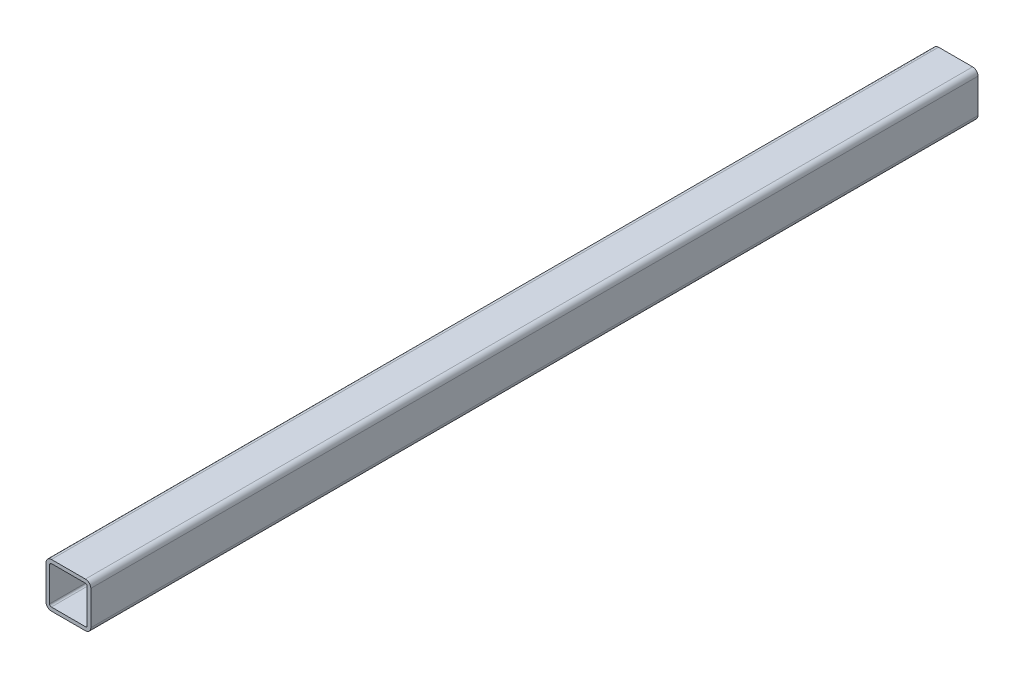
ISO-10303-21;
HEADER;
FILE_DESCRIPTION(('STEP AP214'),'2;1');
FILE_NAME('part.step','',(''),(''),'','','');
FILE_SCHEMA(('AUTOMOTIVE_DESIGN { 1 0 10303 214 1 1 1 1 }'));
ENDSEC;
DATA;
#1=APPLICATION_CONTEXT('core data for automotive mechanical design processes');
#2=APPLICATION_PROTOCOL_DEFINITION('international standard','automotive_design',2000,#1);
#3=PRODUCT_CONTEXT('',#1,'mechanical');
#4=PRODUCT('Part','Part','',(#3));
#5=PRODUCT_RELATED_PRODUCT_CATEGORY('part','',(#4));
#6=PRODUCT_DEFINITION_FORMATION('','',#4);
#7=PRODUCT_DEFINITION_CONTEXT('part definition',#1,'design');
#8=PRODUCT_DEFINITION('design','',#6,#7);
#9=PRODUCT_DEFINITION_SHAPE('','',#8);
#10=(LENGTH_UNIT() NAMED_UNIT(*) SI_UNIT(.MILLI.,.METRE.));
#11=(NAMED_UNIT(*) PLANE_ANGLE_UNIT() SI_UNIT($,.RADIAN.));
#12=(NAMED_UNIT(*) SI_UNIT($,.STERADIAN.) SOLID_ANGLE_UNIT());
#13=UNCERTAINTY_MEASURE_WITH_UNIT(LENGTH_MEASURE(1.E-05),#10,'distance_accuracy_value','');
#14=(GEOMETRIC_REPRESENTATION_CONTEXT(3) GLOBAL_UNCERTAINTY_ASSIGNED_CONTEXT((#13)) GLOBAL_UNIT_ASSIGNED_CONTEXT((#10,
#11,#12)) REPRESENTATION_CONTEXT('',''));
#15=CARTESIAN_POINT('',(0.,0.,0.));
#16=DIRECTION('',(0.,0.,1.));
#17=DIRECTION('',(1.,0.,0.));
#18=AXIS2_PLACEMENT_3D('',#15,#16,#17);
#19=CARTESIAN_POINT('',(0.,0.,495.));
#20=DIRECTION('',(0.,0.,1.));
#21=DIRECTION('',(1.,0.,0.));
#22=AXIS2_PLACEMENT_3D('',#19,#20,#21);
#23=PLANE('',#22);
#24=DIRECTION('',(0.,1.,0.));
#25=VECTOR('',#24,1.);
#26=CARTESIAN_POINT('',(-12.5,-4.75,495.));
#27=LINE('',#26,#25);
#28=CARTESIAN_POINT('',(-12.5,-9.5,495.));
#29=VERTEX_POINT('',#28);
#30=CARTESIAN_POINT('',(-12.5,9.5,495.));
#31=VERTEX_POINT('',#30);
#32=EDGE_CURVE('E204',#29,#31,#27,.T.);
#33=ORIENTED_EDGE('',*,*,#32,.F.);
#34=CARTESIAN_POINT('',(-9.5,-9.5,495.));
#35=DIRECTION('',(0.,0.,-1.));
#36=DIRECTION('',(1.,0.,0.));
#37=AXIS2_PLACEMENT_3D('',#34,#35,#36);
#38=CIRCLE('',#37,3.);
#39=CARTESIAN_POINT('',(-9.5,-12.5,495.));
#40=VERTEX_POINT('',#39);
#41=EDGE_CURVE('E275',#40,#29,#38,.T.);
#42=ORIENTED_EDGE('',*,*,#41,.F.);
#43=DIRECTION('',(-1.,0.,0.));
#44=VECTOR('',#43,1.);
#45=CARTESIAN_POINT('',(4.75,-12.5,495.));
#46=LINE('',#45,#44);
#47=CARTESIAN_POINT('',(9.5,-12.5,495.));
#48=VERTEX_POINT('',#47);
#49=EDGE_CURVE('E252',#48,#40,#46,.T.);
#50=ORIENTED_EDGE('',*,*,#49,.F.);
#51=CARTESIAN_POINT('',(9.5,-9.5,495.));
#52=DIRECTION('',(0.,0.,-1.));
#53=DIRECTION('',(0.,1.,0.));
#54=AXIS2_PLACEMENT_3D('',#51,#52,#53);
#55=CIRCLE('',#54,3.);
#56=CARTESIAN_POINT('',(12.5,-9.5,495.));
#57=VERTEX_POINT('',#56);
#58=EDGE_CURVE('E217',#57,#48,#55,.T.);
#59=ORIENTED_EDGE('',*,*,#58,.F.);
#60=DIRECTION('',(0.,-1.,0.));
#61=VECTOR('',#60,1.);
#62=CARTESIAN_POINT('',(12.5,4.75,495.));
#63=LINE('',#62,#61);
#64=CARTESIAN_POINT('',(12.5,9.5,495.));
#65=VERTEX_POINT('',#64);
#66=EDGE_CURVE('E237',#65,#57,#63,.T.);
#67=ORIENTED_EDGE('',*,*,#66,.F.);
#68=CARTESIAN_POINT('',(9.5,9.5,495.));
#69=DIRECTION('',(0.,0.,-1.));
#70=DIRECTION('',(-1.,0.,0.));
#71=AXIS2_PLACEMENT_3D('',#68,#69,#70);
#72=CIRCLE('',#71,3.);
#73=CARTESIAN_POINT('',(9.5,12.5,495.));
#74=VERTEX_POINT('',#73);
#75=EDGE_CURVE('E27',#74,#65,#72,.T.);
#76=ORIENTED_EDGE('',*,*,#75,.F.);
#77=DIRECTION('',(1.,0.,0.));
#78=VECTOR('',#77,1.);
#79=CARTESIAN_POINT('',(-4.75,12.5,495.));
#80=LINE('',#79,#78);
#81=CARTESIAN_POINT('',(-9.5,12.5,495.));
#82=VERTEX_POINT('',#81);
#83=EDGE_CURVE('E222',#82,#74,#80,.T.);
#84=ORIENTED_EDGE('',*,*,#83,.F.);
#85=CARTESIAN_POINT('',(-9.5,9.5,495.));
#86=DIRECTION('',(0.,0.,-1.));
#87=DIRECTION('',(0.,-1.,0.));
#88=AXIS2_PLACEMENT_3D('',#85,#86,#87);
#89=CIRCLE('',#88,3.);
#90=EDGE_CURVE('E210',#31,#82,#89,.T.);
#91=ORIENTED_EDGE('',*,*,#90,.F.);
#92=EDGE_LOOP('',(#33,#42,#50,#59,#67,#76,#84,#91));
#93=FACE_BOUND('',#92,.T.);
#94=DIRECTION('',(-1.,0.,0.));
#95=VECTOR('',#94,1.);
#96=CARTESIAN_POINT('',(-4.75,10.5,495.));
#97=LINE('',#96,#95);
#98=CARTESIAN_POINT('',(9.5,10.5,495.));
#99=VERTEX_POINT('',#98);
#100=CARTESIAN_POINT('',(-9.5,10.5,495.));
#101=VERTEX_POINT('',#100);
#102=EDGE_CURVE('E257',#99,#101,#97,.T.);
#103=ORIENTED_EDGE('',*,*,#102,.F.);
#104=CARTESIAN_POINT('',(9.5,9.5,495.));
#105=DIRECTION('',(0.,0.,1.));
#106=DIRECTION('',(-1.,0.,0.));
#107=AXIS2_PLACEMENT_3D('',#104,#105,#106);
#108=CIRCLE('',#107,1.);
#109=CARTESIAN_POINT('',(10.5,9.5,495.));
#110=VERTEX_POINT('',#109);
#111=EDGE_CURVE('E320',#110,#99,#108,.T.);
#112=ORIENTED_EDGE('',*,*,#111,.F.);
#113=DIRECTION('',(0.,1.,0.));
#114=VECTOR('',#113,1.);
#115=CARTESIAN_POINT('',(10.5,4.75,495.));
#116=LINE('',#115,#114);
#117=CARTESIAN_POINT('',(10.5,-9.5,495.));
#118=VERTEX_POINT('',#117);
#119=EDGE_CURVE('E236',#118,#110,#116,.T.);
#120=ORIENTED_EDGE('',*,*,#119,.F.);
#121=CARTESIAN_POINT('',(9.5,-9.5,495.));
#122=DIRECTION('',(0.,0.,1.));
#123=DIRECTION('',(0.,1.,0.));
#124=AXIS2_PLACEMENT_3D('',#121,#122,#123);
#125=CIRCLE('',#124,1.);
#126=CARTESIAN_POINT('',(9.5,-10.5,495.));
#127=VERTEX_POINT('',#126);
#128=EDGE_CURVE('E251',#127,#118,#125,.T.);
#129=ORIENTED_EDGE('',*,*,#128,.F.);
#130=DIRECTION('',(1.,0.,0.));
#131=VECTOR('',#130,1.);
#132=CARTESIAN_POINT('',(4.75,-10.5,495.));
#133=LINE('',#132,#131);
#134=CARTESIAN_POINT('',(-9.5,-10.5,495.));
#135=VERTEX_POINT('',#134);
#136=EDGE_CURVE('E349',#135,#127,#133,.T.);
#137=ORIENTED_EDGE('',*,*,#136,.F.);
#138=CARTESIAN_POINT('',(-9.5,-9.5,495.));
#139=DIRECTION('',(0.,0.,1.));
#140=DIRECTION('',(1.,0.,0.));
#141=AXIS2_PLACEMENT_3D('',#138,#139,#140);
#142=CIRCLE('',#141,1.);
#143=CARTESIAN_POINT('',(-10.5,-9.5,495.));
#144=VERTEX_POINT('',#143);
#145=EDGE_CURVE('E190',#144,#135,#142,.T.);
#146=ORIENTED_EDGE('',*,*,#145,.F.);
#147=DIRECTION('',(0.,-1.,0.));
#148=VECTOR('',#147,1.);
#149=CARTESIAN_POINT('',(-10.5,-4.75,495.));
#150=LINE('',#149,#148);
#151=CARTESIAN_POINT('',(-10.5,9.5,495.));
#152=VERTEX_POINT('',#151);
#153=EDGE_CURVE('E175',#152,#144,#150,.T.);
#154=ORIENTED_EDGE('',*,*,#153,.F.);
#155=CARTESIAN_POINT('',(-9.5,9.5,495.));
#156=DIRECTION('',(0.,0.,1.));
#157=DIRECTION('',(0.,-1.,0.));
#158=AXIS2_PLACEMENT_3D('',#155,#156,#157);
#159=CIRCLE('',#158,1.);
#160=EDGE_CURVE('E205',#101,#152,#159,.T.);
#161=ORIENTED_EDGE('',*,*,#160,.F.);
#162=EDGE_LOOP('',(#103,#112,#120,#129,#137,#146,#154,#161));
#163=FACE_BOUND('',#162,.T.);
#164=ADVANCED_FACE('F16',(#93,#163),#23,.T.);
#165=CARTESIAN_POINT('',(0.,0.,0.));
#166=DIRECTION('',(0.,0.,1.));
#167=DIRECTION('',(1.,0.,0.));
#168=AXIS2_PLACEMENT_3D('',#165,#166,#167);
#169=PLANE('',#168);
#170=DIRECTION('',(0.,1.,0.));
#171=VECTOR('',#170,1.);
#172=CARTESIAN_POINT('',(-12.5,-4.75,0.));
#173=LINE('',#172,#171);
#174=CARTESIAN_POINT('',(-12.5,-9.5,0.));
#175=VERTEX_POINT('',#174);
#176=CARTESIAN_POINT('',(-12.5,9.5,0.));
#177=VERTEX_POINT('',#176);
#178=EDGE_CURVE('E206',#175,#177,#173,.T.);
#179=ORIENTED_EDGE('',*,*,#178,.T.);
#180=CARTESIAN_POINT('',(-9.5,9.5,0.));
#181=DIRECTION('',(0.,0.,-1.));
#182=DIRECTION('',(0.,-1.,0.));
#183=AXIS2_PLACEMENT_3D('',#180,#181,#182);
#184=CIRCLE('',#183,3.);
#185=CARTESIAN_POINT('',(-9.5,12.5,0.));
#186=VERTEX_POINT('',#185);
#187=EDGE_CURVE('E218',#177,#186,#184,.T.);
#188=ORIENTED_EDGE('',*,*,#187,.T.);
#189=DIRECTION('',(1.,0.,0.));
#190=VECTOR('',#189,1.);
#191=CARTESIAN_POINT('',(-4.75,12.5,0.));
#192=LINE('',#191,#190);
#193=CARTESIAN_POINT('',(9.5,12.5,0.));
#194=VERTEX_POINT('',#193);
#195=EDGE_CURVE('E245',#186,#194,#192,.T.);
#196=ORIENTED_EDGE('',*,*,#195,.T.);
#197=CARTESIAN_POINT('',(9.5,9.5,0.));
#198=DIRECTION('',(0.,0.,-1.));
#199=DIRECTION('',(-1.,0.,0.));
#200=AXIS2_PLACEMENT_3D('',#197,#198,#199);
#201=CIRCLE('',#200,3.);
#202=CARTESIAN_POINT('',(12.5,9.5,0.));
#203=VERTEX_POINT('',#202);
#204=EDGE_CURVE('E11',#194,#203,#201,.T.);
#205=ORIENTED_EDGE('',*,*,#204,.T.);
#206=DIRECTION('',(0.,-1.,0.));
#207=VECTOR('',#206,1.);
#208=CARTESIAN_POINT('',(12.5,4.75,0.));
#209=LINE('',#208,#207);
#210=CARTESIAN_POINT('',(12.5,-9.5,0.));
#211=VERTEX_POINT('',#210);
#212=EDGE_CURVE('E286',#203,#211,#209,.T.);
#213=ORIENTED_EDGE('',*,*,#212,.T.);
#214=CARTESIAN_POINT('',(9.5,-9.5,0.));
#215=DIRECTION('',(0.,0.,-1.));
#216=DIRECTION('',(0.,1.,0.));
#217=AXIS2_PLACEMENT_3D('',#214,#215,#216);
#218=CIRCLE('',#217,3.);
#219=CARTESIAN_POINT('',(9.5,-12.5,0.));
#220=VERTEX_POINT('',#219);
#221=EDGE_CURVE('E216',#211,#220,#218,.T.);
#222=ORIENTED_EDGE('',*,*,#221,.T.);
#223=DIRECTION('',(-1.,0.,0.));
#224=VECTOR('',#223,1.);
#225=CARTESIAN_POINT('',(4.75,-12.5,0.));
#226=LINE('',#225,#224);
#227=CARTESIAN_POINT('',(-9.5,-12.5,0.));
#228=VERTEX_POINT('',#227);
#229=EDGE_CURVE('E271',#220,#228,#226,.T.);
#230=ORIENTED_EDGE('',*,*,#229,.T.);
#231=CARTESIAN_POINT('',(-9.5,-9.5,0.));
#232=DIRECTION('',(0.,0.,-1.));
#233=DIRECTION('',(1.,0.,0.));
#234=AXIS2_PLACEMENT_3D('',#231,#232,#233);
#235=CIRCLE('',#234,3.);
#236=EDGE_CURVE('E262',#228,#175,#235,.T.);
#237=ORIENTED_EDGE('',*,*,#236,.T.);
#238=EDGE_LOOP('',(#179,#188,#196,#205,#213,#222,#230,#237));
#239=FACE_BOUND('',#238,.T.);
#240=DIRECTION('',(-1.,0.,0.));
#241=VECTOR('',#240,1.);
#242=CARTESIAN_POINT('',(-4.75,10.5,0.));
#243=LINE('',#242,#241);
#244=CARTESIAN_POINT('',(9.5,10.5,0.));
#245=VERTEX_POINT('',#244);
#246=CARTESIAN_POINT('',(-9.5,10.5,0.));
#247=VERTEX_POINT('',#246);
#248=EDGE_CURVE('E196',#245,#247,#243,.T.);
#249=ORIENTED_EDGE('',*,*,#248,.T.);
#250=CARTESIAN_POINT('',(-9.5,9.5,0.));
#251=DIRECTION('',(0.,0.,1.));
#252=DIRECTION('',(0.,-1.,0.));
#253=AXIS2_PLACEMENT_3D('',#250,#251,#252);
#254=CIRCLE('',#253,1.);
#255=CARTESIAN_POINT('',(-10.5,9.5,0.));
#256=VERTEX_POINT('',#255);
#257=EDGE_CURVE('E169',#247,#256,#254,.T.);
#258=ORIENTED_EDGE('',*,*,#257,.T.);
#259=DIRECTION('',(0.,-1.,0.));
#260=VECTOR('',#259,1.);
#261=CARTESIAN_POINT('',(-10.5,-4.75,0.));
#262=LINE('',#261,#260);
#263=CARTESIAN_POINT('',(-10.5,-9.5,0.));
#264=VERTEX_POINT('',#263);
#265=EDGE_CURVE('E161',#256,#264,#262,.T.);
#266=ORIENTED_EDGE('',*,*,#265,.T.);
#267=CARTESIAN_POINT('',(-9.5,-9.5,0.));
#268=DIRECTION('',(0.,0.,1.));
#269=DIRECTION('',(1.,0.,0.));
#270=AXIS2_PLACEMENT_3D('',#267,#268,#269);
#271=CIRCLE('',#270,1.);
#272=CARTESIAN_POINT('',(-9.5,-10.5,0.));
#273=VERTEX_POINT('',#272);
#274=EDGE_CURVE('E167',#264,#273,#271,.T.);
#275=ORIENTED_EDGE('',*,*,#274,.T.);
#276=DIRECTION('',(1.,0.,0.));
#277=VECTOR('',#276,1.);
#278=CARTESIAN_POINT('',(4.75,-10.5,0.));
#279=LINE('',#278,#277);
#280=CARTESIAN_POINT('',(9.5,-10.5,0.));
#281=VERTEX_POINT('',#280);
#282=EDGE_CURVE('E200',#273,#281,#279,.T.);
#283=ORIENTED_EDGE('',*,*,#282,.T.);
#284=CARTESIAN_POINT('',(9.5,-9.5,0.));
#285=DIRECTION('',(0.,0.,1.));
#286=DIRECTION('',(0.,1.,0.));
#287=AXIS2_PLACEMENT_3D('',#284,#285,#286);
#288=CIRCLE('',#287,1.);
#289=CARTESIAN_POINT('',(10.5,-9.5,0.));
#290=VERTEX_POINT('',#289);
#291=EDGE_CURVE('E250',#281,#290,#288,.T.);
#292=ORIENTED_EDGE('',*,*,#291,.T.);
#293=DIRECTION('',(0.,1.,0.));
#294=VECTOR('',#293,1.);
#295=CARTESIAN_POINT('',(10.5,4.75,0.));
#296=LINE('',#295,#294);
#297=CARTESIAN_POINT('',(10.5,9.5,0.));
#298=VERTEX_POINT('',#297);
#299=EDGE_CURVE('E235',#290,#298,#296,.T.);
#300=ORIENTED_EDGE('',*,*,#299,.T.);
#301=CARTESIAN_POINT('',(9.5,9.5,0.));
#302=DIRECTION('',(0.,0.,1.));
#303=DIRECTION('',(-1.,0.,0.));
#304=AXIS2_PLACEMENT_3D('',#301,#302,#303);
#305=CIRCLE('',#304,1.);
#306=EDGE_CURVE('E241',#298,#245,#305,.T.);
#307=ORIENTED_EDGE('',*,*,#306,.T.);
#308=EDGE_LOOP('',(#249,#258,#266,#275,#283,#292,#300,#307));
#309=FACE_BOUND('',#308,.T.);
#310=ADVANCED_FACE('F164',(#239,#309),#169,.F.);
#311=CARTESIAN_POINT('',(9.5,9.5,0.));
#312=DIRECTION('',(0.,0.,1.));
#313=DIRECTION('',(-1.,0.,0.));
#314=AXIS2_PLACEMENT_3D('',#311,#312,#313);
#315=CYLINDRICAL_SURFACE('',#314,3.);
#316=ORIENTED_EDGE('',*,*,#75,.T.);
#317=DIRECTION('',(0.,0.,1.));
#318=VECTOR('',#317,1.);
#319=CARTESIAN_POINT('',(12.5,9.5,0.));
#320=LINE('',#319,#318);
#321=EDGE_CURVE('E266',#203,#65,#320,.T.);
#322=ORIENTED_EDGE('',*,*,#321,.F.);
#323=ORIENTED_EDGE('',*,*,#204,.F.);
#324=DIRECTION('',(0.,0.,1.));
#325=VECTOR('',#324,1.);
#326=CARTESIAN_POINT('',(9.5,12.5,0.));
#327=LINE('',#326,#325);
#328=EDGE_CURVE('E230',#194,#74,#327,.T.);
#329=ORIENTED_EDGE('',*,*,#328,.T.);
#330=EDGE_LOOP('',(#316,#322,#323,#329));
#331=FACE_BOUND('',#330,.T.);
#332=ADVANCED_FACE('F409',(#331),#315,.T.);
#333=CARTESIAN_POINT('',(-9.5,12.5,0.));
#334=DIRECTION('',(0.,1.,0.));
#335=DIRECTION('',(1.,0.,0.));
#336=AXIS2_PLACEMENT_3D('',#333,#334,#335);
#337=PLANE('',#336);
#338=ORIENTED_EDGE('',*,*,#83,.T.);
#339=ORIENTED_EDGE('',*,*,#328,.F.);
#340=ORIENTED_EDGE('',*,*,#195,.F.);
#341=DIRECTION('',(0.,0.,1.));
#342=VECTOR('',#341,1.);
#343=CARTESIAN_POINT('',(-9.5,12.5,0.));
#344=LINE('',#343,#342);
#345=EDGE_CURVE('E223',#186,#82,#344,.T.);
#346=ORIENTED_EDGE('',*,*,#345,.T.);
#347=EDGE_LOOP('',(#338,#339,#340,#346));
#348=FACE_BOUND('',#347,.T.);
#349=ADVANCED_FACE('F449',(#348),#337,.T.);
#350=CARTESIAN_POINT('',(-9.5,9.5,0.));
#351=DIRECTION('',(0.,0.,1.));
#352=DIRECTION('',(0.,-1.,0.));
#353=AXIS2_PLACEMENT_3D('',#350,#351,#352);
#354=CYLINDRICAL_SURFACE('',#353,3.);
#355=ORIENTED_EDGE('',*,*,#90,.T.);
#356=ORIENTED_EDGE('',*,*,#345,.F.);
#357=ORIENTED_EDGE('',*,*,#187,.F.);
#358=DIRECTION('',(0.,0.,1.));
#359=VECTOR('',#358,1.);
#360=CARTESIAN_POINT('',(-12.5,9.5,0.));
#361=LINE('',#360,#359);
#362=EDGE_CURVE('E211',#177,#31,#361,.T.);
#363=ORIENTED_EDGE('',*,*,#362,.T.);
#364=EDGE_LOOP('',(#355,#356,#357,#363));
#365=FACE_BOUND('',#364,.T.);
#366=ADVANCED_FACE('F413',(#365),#354,.T.);
#367=CARTESIAN_POINT('',(-12.5,-9.5,0.));
#368=DIRECTION('',(-1.,0.,0.));
#369=DIRECTION('',(0.,1.,0.));
#370=AXIS2_PLACEMENT_3D('',#367,#368,#369);
#371=PLANE('',#370);
#372=ORIENTED_EDGE('',*,*,#32,.T.);
#373=ORIENTED_EDGE('',*,*,#362,.F.);
#374=ORIENTED_EDGE('',*,*,#178,.F.);
#375=DIRECTION('',(0.,0.,1.));
#376=VECTOR('',#375,1.);
#377=CARTESIAN_POINT('',(-12.5,-9.5,0.));
#378=LINE('',#377,#376);
#379=EDGE_CURVE('E279',#175,#29,#378,.T.);
#380=ORIENTED_EDGE('',*,*,#379,.T.);
#381=EDGE_LOOP('',(#372,#373,#374,#380));
#382=FACE_BOUND('',#381,.T.);
#383=ADVANCED_FACE('F433',(#382),#371,.T.);
#384=CARTESIAN_POINT('',(-9.5,9.5,0.));
#385=DIRECTION('',(0.,0.,1.));
#386=DIRECTION('',(0.,-1.,0.));
#387=AXIS2_PLACEMENT_3D('',#384,#385,#386);
#388=CYLINDRICAL_SURFACE('',#387,1.);
#389=ORIENTED_EDGE('',*,*,#160,.T.);
#390=DIRECTION('',(0.,0.,1.));
#391=VECTOR('',#390,1.);
#392=CARTESIAN_POINT('',(-10.5,9.5,0.));
#393=LINE('',#392,#391);
#394=EDGE_CURVE('E174',#256,#152,#393,.T.);
#395=ORIENTED_EDGE('',*,*,#394,.F.);
#396=ORIENTED_EDGE('',*,*,#257,.F.);
#397=DIRECTION('',(0.,0.,1.));
#398=VECTOR('',#397,1.);
#399=CARTESIAN_POINT('',(-9.5,10.5,0.));
#400=LINE('',#399,#398);
#401=EDGE_CURVE('E261',#247,#101,#400,.T.);
#402=ORIENTED_EDGE('',*,*,#401,.T.);
#403=EDGE_LOOP('',(#389,#395,#396,#402));
#404=FACE_BOUND('',#403,.T.);
#405=ADVANCED_FACE('F344',(#404),#388,.F.);
#406=CARTESIAN_POINT('',(-10.5,-9.5,0.));
#407=DIRECTION('',(-1.,0.,0.));
#408=DIRECTION('',(0.,0.,1.));
#409=AXIS2_PLACEMENT_3D('',#406,#407,#408);
#410=PLANE('',#409);
#411=ORIENTED_EDGE('',*,*,#153,.T.);
#412=DIRECTION('',(0.,0.,1.));
#413=VECTOR('',#412,1.);
#414=CARTESIAN_POINT('',(-10.5,-9.5,0.));
#415=LINE('',#414,#413);
#416=EDGE_CURVE('E178',#264,#144,#415,.T.);
#417=ORIENTED_EDGE('',*,*,#416,.F.);
#418=ORIENTED_EDGE('',*,*,#265,.F.);
#419=ORIENTED_EDGE('',*,*,#394,.T.);
#420=EDGE_LOOP('',(#411,#417,#418,#419));
#421=FACE_BOUND('',#420,.T.);
#422=ADVANCED_FACE('F179',(#421),#410,.F.);
#423=CARTESIAN_POINT('',(-9.5,-9.5,0.));
#424=DIRECTION('',(0.,0.,1.));
#425=DIRECTION('',(1.,0.,0.));
#426=AXIS2_PLACEMENT_3D('',#423,#424,#425);
#427=CYLINDRICAL_SURFACE('',#426,1.);
#428=ORIENTED_EDGE('',*,*,#145,.T.);
#429=DIRECTION('',(0.,0.,1.));
#430=VECTOR('',#429,1.);
#431=CARTESIAN_POINT('',(-9.5,-10.5,0.));
#432=LINE('',#431,#430);
#433=EDGE_CURVE('E187',#273,#135,#432,.T.);
#434=ORIENTED_EDGE('',*,*,#433,.F.);
#435=ORIENTED_EDGE('',*,*,#274,.F.);
#436=ORIENTED_EDGE('',*,*,#416,.T.);
#437=EDGE_LOOP('',(#428,#434,#435,#436));
#438=FACE_BOUND('',#437,.T.);
#439=ADVANCED_FACE('F185',(#438),#427,.F.);
#440=CARTESIAN_POINT('',(-9.5,10.5,0.));
#441=DIRECTION('',(0.,1.,0.));
#442=DIRECTION('',(1.,0.,0.));
#443=AXIS2_PLACEMENT_3D('',#440,#441,#442);
#444=PLANE('',#443);
#445=ORIENTED_EDGE('',*,*,#102,.T.);
#446=ORIENTED_EDGE('',*,*,#401,.F.);
#447=ORIENTED_EDGE('',*,*,#248,.F.);
#448=DIRECTION('',(0.,0.,1.));
#449=VECTOR('',#448,1.);
#450=CARTESIAN_POINT('',(9.5,10.5,0.));
#451=LINE('',#450,#449);
#452=EDGE_CURVE('E291',#245,#99,#451,.T.);
#453=ORIENTED_EDGE('',*,*,#452,.T.);
#454=EDGE_LOOP('',(#445,#446,#447,#453));
#455=FACE_BOUND('',#454,.T.);
#456=ADVANCED_FACE('F390',(#455),#444,.F.);
#457=CARTESIAN_POINT('',(-9.5,-9.5,0.));
#458=DIRECTION('',(0.,0.,1.));
#459=DIRECTION('',(1.,0.,0.));
#460=AXIS2_PLACEMENT_3D('',#457,#458,#459);
#461=CYLINDRICAL_SURFACE('',#460,3.);
#462=ORIENTED_EDGE('',*,*,#41,.T.);
#463=ORIENTED_EDGE('',*,*,#379,.F.);
#464=ORIENTED_EDGE('',*,*,#236,.F.);
#465=DIRECTION('',(0.,0.,1.));
#466=VECTOR('',#465,1.);
#467=CARTESIAN_POINT('',(-9.5,-12.5,0.));
#468=LINE('',#467,#466);
#469=EDGE_CURVE('E256',#228,#40,#468,.T.);
#470=ORIENTED_EDGE('',*,*,#469,.T.);
#471=EDGE_LOOP('',(#462,#463,#464,#470));
#472=FACE_BOUND('',#471,.T.);
#473=ADVANCED_FACE('F419',(#472),#461,.T.);
#474=CARTESIAN_POINT('',(9.5,-12.5,0.));
#475=DIRECTION('',(0.,-1.,0.));
#476=DIRECTION('',(0.,0.,-1.));
#477=AXIS2_PLACEMENT_3D('',#474,#475,#476);
#478=PLANE('',#477);
#479=ORIENTED_EDGE('',*,*,#49,.T.);
#480=ORIENTED_EDGE('',*,*,#469,.F.);
#481=ORIENTED_EDGE('',*,*,#229,.F.);
#482=DIRECTION('',(0.,0.,1.));
#483=VECTOR('',#482,1.);
#484=CARTESIAN_POINT('',(9.5,-12.5,0.));
#485=LINE('',#484,#483);
#486=EDGE_CURVE('E212',#220,#48,#485,.T.);
#487=ORIENTED_EDGE('',*,*,#486,.T.);
#488=EDGE_LOOP('',(#479,#480,#481,#487));
#489=FACE_BOUND('',#488,.T.);
#490=ADVANCED_FACE('F18',(#489),#478,.T.);
#491=CARTESIAN_POINT('',(9.5,-9.5,0.));
#492=DIRECTION('',(0.,0.,1.));
#493=DIRECTION('',(0.,1.,0.));
#494=AXIS2_PLACEMENT_3D('',#491,#492,#493);
#495=CYLINDRICAL_SURFACE('',#494,3.);
#496=ORIENTED_EDGE('',*,*,#58,.T.);
#497=ORIENTED_EDGE('',*,*,#486,.F.);
#498=ORIENTED_EDGE('',*,*,#221,.F.);
#499=DIRECTION('',(0.,0.,1.));
#500=VECTOR('',#499,1.);
#501=CARTESIAN_POINT('',(12.5,-9.5,0.));
#502=LINE('',#501,#500);
#503=EDGE_CURVE('E240',#211,#57,#502,.T.);
#504=ORIENTED_EDGE('',*,*,#503,.T.);
#505=EDGE_LOOP('',(#496,#497,#498,#504));
#506=FACE_BOUND('',#505,.T.);
#507=ADVANCED_FACE('F414',(#506),#495,.T.);
#508=CARTESIAN_POINT('',(12.5,9.5,0.));
#509=DIRECTION('',(1.,0.,0.));
#510=DIRECTION('',(0.,1.,0.));
#511=AXIS2_PLACEMENT_3D('',#508,#509,#510);
#512=PLANE('',#511);
#513=ORIENTED_EDGE('',*,*,#66,.T.);
#514=ORIENTED_EDGE('',*,*,#503,.F.);
#515=ORIENTED_EDGE('',*,*,#212,.F.);
#516=ORIENTED_EDGE('',*,*,#321,.T.);
#517=EDGE_LOOP('',(#513,#514,#515,#516));
#518=FACE_BOUND('',#517,.T.);
#519=ADVANCED_FACE('F417',(#518),#512,.T.);
#520=CARTESIAN_POINT('',(9.5,9.5,0.));
#521=DIRECTION('',(0.,0.,1.));
#522=DIRECTION('',(-1.,0.,0.));
#523=AXIS2_PLACEMENT_3D('',#520,#521,#522);
#524=CYLINDRICAL_SURFACE('',#523,1.);
#525=ORIENTED_EDGE('',*,*,#111,.T.);
#526=ORIENTED_EDGE('',*,*,#452,.F.);
#527=ORIENTED_EDGE('',*,*,#306,.F.);
#528=DIRECTION('',(0.,0.,1.));
#529=VECTOR('',#528,1.);
#530=CARTESIAN_POINT('',(10.5,9.5,0.));
#531=LINE('',#530,#529);
#532=EDGE_CURVE('E231',#298,#110,#531,.T.);
#533=ORIENTED_EDGE('',*,*,#532,.T.);
#534=EDGE_LOOP('',(#525,#526,#527,#533));
#535=FACE_BOUND('',#534,.T.);
#536=ADVANCED_FACE('F387',(#535),#524,.F.);
#537=CARTESIAN_POINT('',(10.5,9.5,0.));
#538=DIRECTION('',(1.,0.,0.));
#539=DIRECTION('',(0.,-1.,0.));
#540=AXIS2_PLACEMENT_3D('',#537,#538,#539);
#541=PLANE('',#540);
#542=ORIENTED_EDGE('',*,*,#119,.T.);
#543=ORIENTED_EDGE('',*,*,#532,.F.);
#544=ORIENTED_EDGE('',*,*,#299,.F.);
#545=DIRECTION('',(0.,0.,1.));
#546=VECTOR('',#545,1.);
#547=CARTESIAN_POINT('',(10.5,-9.5,0.));
#548=LINE('',#547,#546);
#549=EDGE_CURVE('E246',#290,#118,#548,.T.);
#550=ORIENTED_EDGE('',*,*,#549,.T.);
#551=EDGE_LOOP('',(#542,#543,#544,#550));
#552=FACE_BOUND('',#551,.T.);
#553=ADVANCED_FACE('F385',(#552),#541,.F.);
#554=CARTESIAN_POINT('',(9.5,-9.5,0.));
#555=DIRECTION('',(0.,0.,1.));
#556=DIRECTION('',(0.,1.,0.));
#557=AXIS2_PLACEMENT_3D('',#554,#555,#556);
#558=CYLINDRICAL_SURFACE('',#557,1.);
#559=ORIENTED_EDGE('',*,*,#128,.T.);
#560=ORIENTED_EDGE('',*,*,#549,.F.);
#561=ORIENTED_EDGE('',*,*,#291,.F.);
#562=DIRECTION('',(0.,0.,1.));
#563=VECTOR('',#562,1.);
#564=CARTESIAN_POINT('',(9.5,-10.5,0.));
#565=LINE('',#564,#563);
#566=EDGE_CURVE('E20',#281,#127,#565,.T.);
#567=ORIENTED_EDGE('',*,*,#566,.T.);
#568=EDGE_LOOP('',(#559,#560,#561,#567));
#569=FACE_BOUND('',#568,.T.);
#570=ADVANCED_FACE('F391',(#569),#558,.F.);
#571=CARTESIAN_POINT('',(9.5,-10.5,0.));
#572=DIRECTION('',(0.,-1.,0.));
#573=DIRECTION('',(0.,0.,-1.));
#574=AXIS2_PLACEMENT_3D('',#571,#572,#573);
#575=PLANE('',#574);
#576=ORIENTED_EDGE('',*,*,#136,.T.);
#577=ORIENTED_EDGE('',*,*,#566,.F.);
#578=ORIENTED_EDGE('',*,*,#282,.F.);
#579=ORIENTED_EDGE('',*,*,#433,.T.);
#580=EDGE_LOOP('',(#576,#577,#578,#579));
#581=FACE_BOUND('',#580,.T.);
#582=ADVANCED_FACE('F351',(#581),#575,.F.);
#583=CLOSED_SHELL('',(#164,#310,#332,#349,#366,#383,#405,#422,#439,#456,#473,#490,#507,#519,
#536,#553,#570,#582));
#584=MANIFOLD_SOLID_BREP('B1',#583);
#585=ADVANCED_BREP_SHAPE_REPRESENTATION('',(#18,#584),#14);
#586=SHAPE_DEFINITION_REPRESENTATION(#9,#585);
ENDSEC;
END-ISO-10303-21;
